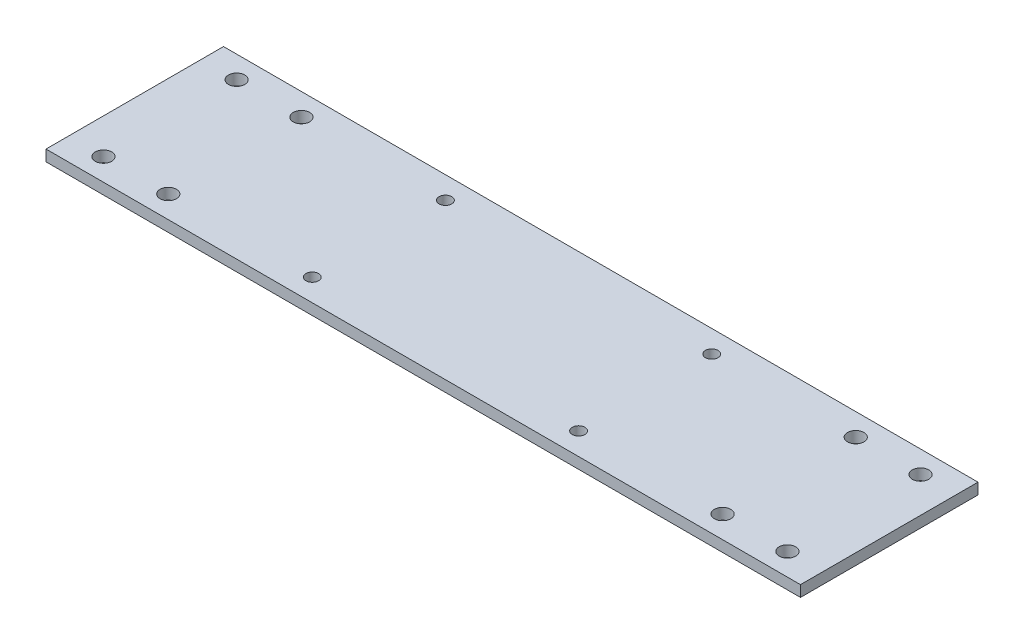
ISO-10303-21;
HEADER;
FILE_DESCRIPTION(('STEP AP214'),'2;1');
FILE_NAME('part.step','',(''),(''),'','','');
FILE_SCHEMA(('AUTOMOTIVE_DESIGN { 1 0 10303 214 1 1 1 1 }'));
ENDSEC;
DATA;
#1=APPLICATION_CONTEXT('core data for automotive mechanical design processes');
#2=APPLICATION_PROTOCOL_DEFINITION('international standard','automotive_design',2000,#1);
#3=PRODUCT_CONTEXT('',#1,'mechanical');
#4=PRODUCT('Part','Part','',(#3));
#5=PRODUCT_RELATED_PRODUCT_CATEGORY('part','',(#4));
#6=PRODUCT_DEFINITION_FORMATION('','',#4);
#7=PRODUCT_DEFINITION_CONTEXT('part definition',#1,'design');
#8=PRODUCT_DEFINITION('design','',#6,#7);
#9=PRODUCT_DEFINITION_SHAPE('','',#8);
#10=(LENGTH_UNIT() NAMED_UNIT(*) SI_UNIT(.MILLI.,.METRE.));
#11=(NAMED_UNIT(*) PLANE_ANGLE_UNIT() SI_UNIT($,.RADIAN.));
#12=(NAMED_UNIT(*) SI_UNIT($,.STERADIAN.) SOLID_ANGLE_UNIT());
#13=UNCERTAINTY_MEASURE_WITH_UNIT(LENGTH_MEASURE(1.E-05),#10,'distance_accuracy_value','');
#14=(GEOMETRIC_REPRESENTATION_CONTEXT(3) GLOBAL_UNCERTAINTY_ASSIGNED_CONTEXT((#13)) GLOBAL_UNIT_ASSIGNED_CONTEXT((#10,
#11,#12)) REPRESENTATION_CONTEXT('',''));
#15=CARTESIAN_POINT('',(0.,0.,0.));
#16=DIRECTION('',(0.,0.,1.));
#17=DIRECTION('',(1.,0.,0.));
#18=AXIS2_PLACEMENT_3D('',#15,#16,#17);
#19=CARTESIAN_POINT('',(0.,3.175,0.));
#20=DIRECTION('',(0.,-1.,0.));
#21=DIRECTION('',(0.,0.,-1.));
#22=AXIS2_PLACEMENT_3D('',#19,#20,#21);
#23=PLANE('',#22);
#24=CARTESIAN_POINT('',(97.8535,3.175,19.05));
#25=DIRECTION('',(0.,1.,0.));
#26=DIRECTION('',(0.,0.,-1.));
#27=AXIS2_PLACEMENT_3D('',#24,#25,#26);
#28=CIRCLE('',#27,2.3495);
#29=CARTESIAN_POINT('',(97.8535,3.175,16.7005));
#30=VERTEX_POINT('',#29);
#31=EDGE_CURVE('E164',#30,#30,#28,.T.);
#32=ORIENTED_EDGE('',*,*,#31,.F.);
#33=EDGE_LOOP('',(#32));
#34=FACE_BOUND('',#33,.T.);
#35=CARTESIAN_POINT('',(-97.8535,3.175,19.05));
#36=DIRECTION('',(0.,1.,0.));
#37=DIRECTION('',(0.,0.,1.));
#38=AXIS2_PLACEMENT_3D('',#35,#36,#37);
#39=CIRCLE('',#38,2.3495);
#40=CARTESIAN_POINT('',(-97.8535,3.175,21.3995));
#41=VERTEX_POINT('',#40);
#42=EDGE_CURVE('E153',#41,#41,#39,.T.);
#43=ORIENTED_EDGE('',*,*,#42,.F.);
#44=EDGE_LOOP('',(#43));
#45=FACE_BOUND('',#44,.T.);
#46=CARTESIAN_POINT('',(-79.3115,3.175,19.05));
#47=DIRECTION('',(0.,1.,0.));
#48=DIRECTION('',(0.,0.,1.));
#49=AXIS2_PLACEMENT_3D('',#46,#47,#48);
#50=CIRCLE('',#49,2.3495);
#51=CARTESIAN_POINT('',(-79.3115,3.175,21.3995));
#52=VERTEX_POINT('',#51);
#53=EDGE_CURVE('E152',#52,#52,#50,.T.);
#54=ORIENTED_EDGE('',*,*,#53,.F.);
#55=EDGE_LOOP('',(#54));
#56=FACE_BOUND('',#55,.T.);
#57=CARTESIAN_POINT('',(-79.3115,3.175,-19.05));
#58=DIRECTION('',(0.,1.,0.));
#59=DIRECTION('',(0.,0.,1.));
#60=AXIS2_PLACEMENT_3D('',#57,#58,#59);
#61=CIRCLE('',#60,2.3495);
#62=CARTESIAN_POINT('',(-79.3115,3.175,-16.7005));
#63=VERTEX_POINT('',#62);
#64=EDGE_CURVE('E146',#63,#63,#61,.T.);
#65=ORIENTED_EDGE('',*,*,#64,.F.);
#66=EDGE_LOOP('',(#65));
#67=FACE_BOUND('',#66,.T.);
#68=CARTESIAN_POINT('',(79.3115,3.175,19.05));
#69=DIRECTION('',(0.,1.,0.));
#70=DIRECTION('',(0.,0.,-1.));
#71=AXIS2_PLACEMENT_3D('',#68,#69,#70);
#72=CIRCLE('',#71,2.3495);
#73=CARTESIAN_POINT('',(79.3115,3.175,16.7005));
#74=VERTEX_POINT('',#73);
#75=EDGE_CURVE('E165',#74,#74,#72,.T.);
#76=ORIENTED_EDGE('',*,*,#75,.F.);
#77=EDGE_LOOP('',(#76));
#78=FACE_BOUND('',#77,.T.);
#79=CARTESIAN_POINT('',(79.3115,3.175,-19.05));
#80=DIRECTION('',(0.,1.,0.));
#81=DIRECTION('',(0.,0.,-1.));
#82=AXIS2_PLACEMENT_3D('',#79,#80,#81);
#83=CIRCLE('',#82,2.3495);
#84=CARTESIAN_POINT('',(79.3115,3.175,-21.3995));
#85=VERTEX_POINT('',#84);
#86=EDGE_CURVE('E182',#85,#85,#83,.T.);
#87=ORIENTED_EDGE('',*,*,#86,.F.);
#88=EDGE_LOOP('',(#87));
#89=FACE_BOUND('',#88,.T.);
#90=CARTESIAN_POINT('',(97.8535,3.175,-19.05));
#91=DIRECTION('',(0.,1.,0.));
#92=DIRECTION('',(0.,0.,-1.));
#93=AXIS2_PLACEMENT_3D('',#90,#91,#92);
#94=CIRCLE('',#93,2.3495);
#95=CARTESIAN_POINT('',(97.8535,3.175,-21.3995));
#96=VERTEX_POINT('',#95);
#97=EDGE_CURVE('E176',#96,#96,#94,.T.);
#98=ORIENTED_EDGE('',*,*,#97,.F.);
#99=EDGE_LOOP('',(#98));
#100=FACE_BOUND('',#99,.T.);
#101=CARTESIAN_POINT('',(-97.8535,3.175,-19.05));
#102=DIRECTION('',(0.,1.,0.));
#103=DIRECTION('',(0.,0.,1.));
#104=AXIS2_PLACEMENT_3D('',#101,#102,#103);
#105=CIRCLE('',#104,2.3495);
#106=CARTESIAN_POINT('',(-97.8535,3.175,-16.7005));
#107=VERTEX_POINT('',#106);
#108=EDGE_CURVE('E143',#107,#107,#105,.T.);
#109=ORIENTED_EDGE('',*,*,#108,.F.);
#110=EDGE_LOOP('',(#109));
#111=FACE_BOUND('',#110,.T.);
#112=DIRECTION('',(0.,0.,-1.));
#113=VECTOR('',#112,1.);
#114=CARTESIAN_POINT('',(107.95,3.175,25.4));
#115=LINE('',#114,#113);
#116=CARTESIAN_POINT('',(107.95,3.175,25.4));
#117=VERTEX_POINT('',#116);
#118=CARTESIAN_POINT('',(107.95,3.175,-25.4));
#119=VERTEX_POINT('',#118);
#120=EDGE_CURVE('E92',#117,#119,#115,.T.);
#121=ORIENTED_EDGE('',*,*,#120,.T.);
#122=DIRECTION('',(-1.,0.,0.));
#123=VECTOR('',#122,1.);
#124=CARTESIAN_POINT('',(-107.95,3.175,-25.4));
#125=LINE('',#124,#123);
#126=CARTESIAN_POINT('',(-107.95,3.175,-25.4));
#127=VERTEX_POINT('',#126);
#128=EDGE_CURVE('E87',#119,#127,#125,.T.);
#129=ORIENTED_EDGE('',*,*,#128,.T.);
#130=DIRECTION('',(0.,0.,1.));
#131=VECTOR('',#130,1.);
#132=CARTESIAN_POINT('',(-107.95,3.175,25.4));
#133=LINE('',#132,#131);
#134=CARTESIAN_POINT('',(-107.95,3.175,25.4));
#135=VERTEX_POINT('',#134);
#136=EDGE_CURVE('E90',#127,#135,#133,.T.);
#137=ORIENTED_EDGE('',*,*,#136,.T.);
#138=DIRECTION('',(1.,0.,0.));
#139=VECTOR('',#138,1.);
#140=CARTESIAN_POINT('',(-107.95,3.175,25.4));
#141=LINE('',#140,#139);
#142=EDGE_CURVE('E57',#135,#117,#141,.T.);
#143=ORIENTED_EDGE('',*,*,#142,.T.);
#144=EDGE_LOOP('',(#121,#129,#137,#143));
#145=FACE_BOUND('',#144,.T.);
#146=CARTESIAN_POINT('',(-38.1,3.175,-19.05));
#147=DIRECTION('',(0.,1.,0.));
#148=DIRECTION('',(0.,0.,1.));
#149=AXIS2_PLACEMENT_3D('',#146,#147,#148);
#150=CIRCLE('',#149,1.80975);
#151=CARTESIAN_POINT('',(-38.1,3.175,-17.24025));
#152=VERTEX_POINT('',#151);
#153=EDGE_CURVE('E107',#152,#152,#150,.T.);
#154=ORIENTED_EDGE('',*,*,#153,.F.);
#155=EDGE_LOOP('',(#154));
#156=FACE_BOUND('',#155,.T.);
#157=CARTESIAN_POINT('',(-38.1,3.175,19.05));
#158=DIRECTION('',(0.,1.,0.));
#159=DIRECTION('',(0.,0.,1.));
#160=AXIS2_PLACEMENT_3D('',#157,#158,#159);
#161=CIRCLE('',#160,1.80975);
#162=CARTESIAN_POINT('',(-38.1,3.175,20.85975));
#163=VERTEX_POINT('',#162);
#164=EDGE_CURVE('E122',#163,#163,#161,.T.);
#165=ORIENTED_EDGE('',*,*,#164,.F.);
#166=EDGE_LOOP('',(#165));
#167=FACE_BOUND('',#166,.T.);
#168=CARTESIAN_POINT('',(38.1,3.175,-19.05));
#169=DIRECTION('',(0.,1.,0.));
#170=DIRECTION('',(0.,0.,1.));
#171=AXIS2_PLACEMENT_3D('',#168,#169,#170);
#172=CIRCLE('',#171,1.80975);
#173=CARTESIAN_POINT('',(38.1,3.175,-17.24025));
#174=VERTEX_POINT('',#173);
#175=EDGE_CURVE('E128',#174,#174,#172,.T.);
#176=ORIENTED_EDGE('',*,*,#175,.F.);
#177=EDGE_LOOP('',(#176));
#178=FACE_BOUND('',#177,.T.);
#179=CARTESIAN_POINT('',(38.1,3.175,19.05));
#180=DIRECTION('',(0.,1.,0.));
#181=DIRECTION('',(0.,0.,1.));
#182=AXIS2_PLACEMENT_3D('',#179,#180,#181);
#183=CIRCLE('',#182,1.80975);
#184=CARTESIAN_POINT('',(38.1,3.175,20.85975));
#185=VERTEX_POINT('',#184);
#186=EDGE_CURVE('E134',#185,#185,#183,.T.);
#187=ORIENTED_EDGE('',*,*,#186,.F.);
#188=EDGE_LOOP('',(#187));
#189=FACE_BOUND('',#188,.T.);
#190=ADVANCED_FACE('F40',(#34,#45,#56,#67,#78,#89,#100,#111,#145,#156,#167,#178,#189),#23,.F.);
#191=CARTESIAN_POINT('',(0.,0.,0.));
#192=DIRECTION('',(0.,-1.,0.));
#193=DIRECTION('',(0.,0.,-1.));
#194=AXIS2_PLACEMENT_3D('',#191,#192,#193);
#195=PLANE('',#194);
#196=CARTESIAN_POINT('',(97.8535,0.,19.05));
#197=DIRECTION('',(0.,1.,0.));
#198=DIRECTION('',(0.,0.,-1.));
#199=AXIS2_PLACEMENT_3D('',#196,#197,#198);
#200=CIRCLE('',#199,2.3495);
#201=CARTESIAN_POINT('',(97.8535,0.,16.7005));
#202=VERTEX_POINT('',#201);
#203=EDGE_CURVE('E161',#202,#202,#200,.T.);
#204=ORIENTED_EDGE('',*,*,#203,.T.);
#205=EDGE_LOOP('',(#204));
#206=FACE_BOUND('',#205,.T.);
#207=CARTESIAN_POINT('',(-97.8535,0.,19.05));
#208=DIRECTION('',(0.,1.,0.));
#209=DIRECTION('',(0.,0.,1.));
#210=AXIS2_PLACEMENT_3D('',#207,#208,#209);
#211=CIRCLE('',#210,2.3495);
#212=CARTESIAN_POINT('',(-97.8535,0.,21.3995));
#213=VERTEX_POINT('',#212);
#214=EDGE_CURVE('E168',#213,#213,#211,.T.);
#215=ORIENTED_EDGE('',*,*,#214,.T.);
#216=EDGE_LOOP('',(#215));
#217=FACE_BOUND('',#216,.T.);
#218=CARTESIAN_POINT('',(-79.3115,0.,19.05));
#219=DIRECTION('',(0.,1.,0.));
#220=DIRECTION('',(0.,0.,1.));
#221=AXIS2_PLACEMENT_3D('',#218,#219,#220);
#222=CIRCLE('',#221,2.3495);
#223=CARTESIAN_POINT('',(-79.3115,0.,21.3995));
#224=VERTEX_POINT('',#223);
#225=EDGE_CURVE('E149',#224,#224,#222,.T.);
#226=ORIENTED_EDGE('',*,*,#225,.T.);
#227=EDGE_LOOP('',(#226));
#228=FACE_BOUND('',#227,.T.);
#229=CARTESIAN_POINT('',(-79.3115,0.,-19.05));
#230=DIRECTION('',(0.,1.,0.));
#231=DIRECTION('',(0.,0.,1.));
#232=AXIS2_PLACEMENT_3D('',#229,#230,#231);
#233=CIRCLE('',#232,2.3495);
#234=CARTESIAN_POINT('',(-79.3115,0.,-16.7005));
#235=VERTEX_POINT('',#234);
#236=EDGE_CURVE('E156',#235,#235,#233,.T.);
#237=ORIENTED_EDGE('',*,*,#236,.T.);
#238=EDGE_LOOP('',(#237));
#239=FACE_BOUND('',#238,.T.);
#240=CARTESIAN_POINT('',(79.3115,0.,19.05));
#241=DIRECTION('',(0.,1.,0.));
#242=DIRECTION('',(0.,0.,-1.));
#243=AXIS2_PLACEMENT_3D('',#240,#241,#242);
#244=CIRCLE('',#243,2.3495);
#245=CARTESIAN_POINT('',(79.3115,0.,16.7005));
#246=VERTEX_POINT('',#245);
#247=EDGE_CURVE('E185',#246,#246,#244,.T.);
#248=ORIENTED_EDGE('',*,*,#247,.T.);
#249=EDGE_LOOP('',(#248));
#250=FACE_BOUND('',#249,.T.);
#251=CARTESIAN_POINT('',(79.3115,0.,-19.05));
#252=DIRECTION('',(0.,1.,0.));
#253=DIRECTION('',(0.,0.,-1.));
#254=AXIS2_PLACEMENT_3D('',#251,#252,#253);
#255=CIRCLE('',#254,2.3495);
#256=CARTESIAN_POINT('',(79.3115,0.,-21.3995));
#257=VERTEX_POINT('',#256);
#258=EDGE_CURVE('E179',#257,#257,#255,.T.);
#259=ORIENTED_EDGE('',*,*,#258,.T.);
#260=EDGE_LOOP('',(#259));
#261=FACE_BOUND('',#260,.T.);
#262=CARTESIAN_POINT('',(97.8535,0.,-19.05));
#263=DIRECTION('',(0.,1.,0.));
#264=DIRECTION('',(0.,0.,-1.));
#265=AXIS2_PLACEMENT_3D('',#262,#263,#264);
#266=CIRCLE('',#265,2.3495);
#267=CARTESIAN_POINT('',(97.8535,0.,-21.3995));
#268=VERTEX_POINT('',#267);
#269=EDGE_CURVE('E173',#268,#268,#266,.T.);
#270=ORIENTED_EDGE('',*,*,#269,.T.);
#271=EDGE_LOOP('',(#270));
#272=FACE_BOUND('',#271,.T.);
#273=CARTESIAN_POINT('',(-97.8535,0.,-19.05));
#274=DIRECTION('',(0.,1.,0.));
#275=DIRECTION('',(0.,0.,1.));
#276=AXIS2_PLACEMENT_3D('',#273,#274,#275);
#277=CIRCLE('',#276,2.3495);
#278=CARTESIAN_POINT('',(-97.8535,0.,-16.7005));
#279=VERTEX_POINT('',#278);
#280=EDGE_CURVE('E140',#279,#279,#277,.T.);
#281=ORIENTED_EDGE('',*,*,#280,.T.);
#282=EDGE_LOOP('',(#281));
#283=FACE_BOUND('',#282,.T.);
#284=CARTESIAN_POINT('',(38.1,0.,-19.05));
#285=DIRECTION('',(0.,1.,0.));
#286=DIRECTION('',(0.,0.,1.));
#287=AXIS2_PLACEMENT_3D('',#284,#285,#286);
#288=CIRCLE('',#287,1.80975);
#289=CARTESIAN_POINT('',(38.1,0.,-17.24025));
#290=VERTEX_POINT('',#289);
#291=EDGE_CURVE('E131',#290,#290,#288,.T.);
#292=ORIENTED_EDGE('',*,*,#291,.T.);
#293=EDGE_LOOP('',(#292));
#294=FACE_BOUND('',#293,.T.);
#295=CARTESIAN_POINT('',(-38.1,0.,-19.05));
#296=DIRECTION('',(0.,1.,0.));
#297=DIRECTION('',(0.,0.,1.));
#298=AXIS2_PLACEMENT_3D('',#295,#296,#297);
#299=CIRCLE('',#298,1.80975);
#300=CARTESIAN_POINT('',(-38.1,0.,-17.24025));
#301=VERTEX_POINT('',#300);
#302=EDGE_CURVE('E119',#301,#301,#299,.T.);
#303=ORIENTED_EDGE('',*,*,#302,.T.);
#304=EDGE_LOOP('',(#303));
#305=FACE_BOUND('',#304,.T.);
#306=DIRECTION('',(0.,0.,-1.));
#307=VECTOR('',#306,1.);
#308=CARTESIAN_POINT('',(107.95,0.,25.4));
#309=LINE('',#308,#307);
#310=CARTESIAN_POINT('',(107.95,0.,25.4));
#311=VERTEX_POINT('',#310);
#312=CARTESIAN_POINT('',(107.95,0.,-25.4));
#313=VERTEX_POINT('',#312);
#314=EDGE_CURVE('E104',#311,#313,#309,.T.);
#315=ORIENTED_EDGE('',*,*,#314,.F.);
#316=DIRECTION('',(1.,0.,0.));
#317=VECTOR('',#316,1.);
#318=CARTESIAN_POINT('',(-107.95,0.,25.4));
#319=LINE('',#318,#317);
#320=CARTESIAN_POINT('',(-107.95,0.,25.4));
#321=VERTEX_POINT('',#320);
#322=EDGE_CURVE('E80',#321,#311,#319,.T.);
#323=ORIENTED_EDGE('',*,*,#322,.F.);
#324=DIRECTION('',(0.,0.,1.));
#325=VECTOR('',#324,1.);
#326=CARTESIAN_POINT('',(-107.95,0.,25.4));
#327=LINE('',#326,#325);
#328=CARTESIAN_POINT('',(-107.95,0.,-25.4));
#329=VERTEX_POINT('',#328);
#330=EDGE_CURVE('E74',#329,#321,#327,.T.);
#331=ORIENTED_EDGE('',*,*,#330,.F.);
#332=DIRECTION('',(-1.,0.,0.));
#333=VECTOR('',#332,1.);
#334=CARTESIAN_POINT('',(-107.95,0.,-25.4));
#335=LINE('',#334,#333);
#336=EDGE_CURVE('E96',#313,#329,#335,.T.);
#337=ORIENTED_EDGE('',*,*,#336,.F.);
#338=EDGE_LOOP('',(#315,#323,#331,#337));
#339=FACE_BOUND('',#338,.T.);
#340=CARTESIAN_POINT('',(-38.1,0.,19.05));
#341=DIRECTION('',(0.,1.,0.));
#342=DIRECTION('',(0.,0.,1.));
#343=AXIS2_PLACEMENT_3D('',#340,#341,#342);
#344=CIRCLE('',#343,1.80975);
#345=CARTESIAN_POINT('',(-38.1,0.,20.85975));
#346=VERTEX_POINT('',#345);
#347=EDGE_CURVE('E125',#346,#346,#344,.T.);
#348=ORIENTED_EDGE('',*,*,#347,.T.);
#349=EDGE_LOOP('',(#348));
#350=FACE_BOUND('',#349,.T.);
#351=CARTESIAN_POINT('',(38.1,0.,19.05));
#352=DIRECTION('',(0.,1.,0.));
#353=DIRECTION('',(0.,0.,1.));
#354=AXIS2_PLACEMENT_3D('',#351,#352,#353);
#355=CIRCLE('',#354,1.80975);
#356=CARTESIAN_POINT('',(38.1,0.,20.85975));
#357=VERTEX_POINT('',#356);
#358=EDGE_CURVE('E137',#357,#357,#355,.T.);
#359=ORIENTED_EDGE('',*,*,#358,.T.);
#360=EDGE_LOOP('',(#359));
#361=FACE_BOUND('',#360,.T.);
#362=ADVANCED_FACE('F115',(#206,#217,#228,#239,#250,#261,#272,#283,#294,#305,#339,#350,#361),
#195,.T.);
#363=CARTESIAN_POINT('',(107.95,3.175,25.4));
#364=DIRECTION('',(-1.,0.,0.));
#365=DIRECTION('',(0.,0.,1.));
#366=AXIS2_PLACEMENT_3D('',#363,#364,#365);
#367=PLANE('',#366);
#368=ORIENTED_EDGE('',*,*,#314,.T.);
#369=DIRECTION('',(0.,-1.,0.));
#370=VECTOR('',#369,1.);
#371=CARTESIAN_POINT('',(107.95,3.175,-25.4));
#372=LINE('',#371,#370);
#373=EDGE_CURVE('E11',#119,#313,#372,.T.);
#374=ORIENTED_EDGE('',*,*,#373,.F.);
#375=ORIENTED_EDGE('',*,*,#120,.F.);
#376=DIRECTION('',(0.,-1.,0.));
#377=VECTOR('',#376,1.);
#378=CARTESIAN_POINT('',(107.95,3.175,25.4));
#379=LINE('',#378,#377);
#380=EDGE_CURVE('E100',#117,#311,#379,.T.);
#381=ORIENTED_EDGE('',*,*,#380,.T.);
#382=EDGE_LOOP('',(#368,#374,#375,#381));
#383=FACE_BOUND('',#382,.T.);
#384=ADVANCED_FACE('F42',(#383),#367,.F.);
#385=CARTESIAN_POINT('',(-107.95,3.175,-25.4));
#386=DIRECTION('',(0.,0.,1.));
#387=DIRECTION('',(1.,0.,0.));
#388=AXIS2_PLACEMENT_3D('',#385,#386,#387);
#389=PLANE('',#388);
#390=ORIENTED_EDGE('',*,*,#336,.T.);
#391=DIRECTION('',(0.,-1.,0.));
#392=VECTOR('',#391,1.);
#393=CARTESIAN_POINT('',(-107.95,3.175,-25.4));
#394=LINE('',#393,#392);
#395=EDGE_CURVE('E49',#127,#329,#394,.T.);
#396=ORIENTED_EDGE('',*,*,#395,.F.);
#397=ORIENTED_EDGE('',*,*,#128,.F.);
#398=ORIENTED_EDGE('',*,*,#373,.T.);
#399=EDGE_LOOP('',(#390,#396,#397,#398));
#400=FACE_BOUND('',#399,.T.);
#401=ADVANCED_FACE('F95',(#400),#389,.F.);
#402=CARTESIAN_POINT('',(-107.95,3.175,25.4));
#403=DIRECTION('',(1.,0.,0.));
#404=DIRECTION('',(0.,0.,-1.));
#405=AXIS2_PLACEMENT_3D('',#402,#403,#404);
#406=PLANE('',#405);
#407=ORIENTED_EDGE('',*,*,#330,.T.);
#408=DIRECTION('',(0.,-1.,0.));
#409=VECTOR('',#408,1.);
#410=CARTESIAN_POINT('',(-107.95,3.175,25.4));
#411=LINE('',#410,#409);
#412=EDGE_CURVE('E97',#135,#321,#411,.T.);
#413=ORIENTED_EDGE('',*,*,#412,.F.);
#414=ORIENTED_EDGE('',*,*,#136,.F.);
#415=ORIENTED_EDGE('',*,*,#395,.T.);
#416=EDGE_LOOP('',(#407,#413,#414,#415));
#417=FACE_BOUND('',#416,.T.);
#418=ADVANCED_FACE('F98',(#417),#406,.F.);
#419=CARTESIAN_POINT('',(-107.95,3.175,25.4));
#420=DIRECTION('',(0.,0.,-1.));
#421=DIRECTION('',(-1.,0.,0.));
#422=AXIS2_PLACEMENT_3D('',#419,#420,#421);
#423=PLANE('',#422);
#424=ORIENTED_EDGE('',*,*,#322,.T.);
#425=ORIENTED_EDGE('',*,*,#380,.F.);
#426=ORIENTED_EDGE('',*,*,#142,.F.);
#427=ORIENTED_EDGE('',*,*,#412,.T.);
#428=EDGE_LOOP('',(#424,#425,#426,#427));
#429=FACE_BOUND('',#428,.T.);
#430=ADVANCED_FACE('F112',(#429),#423,.F.);
#431=CARTESIAN_POINT('',(-38.1,3.175,-19.05));
#432=DIRECTION('',(0.,-1.,0.));
#433=DIRECTION('',(0.,0.,-1.));
#434=AXIS2_PLACEMENT_3D('',#431,#432,#433);
#435=CYLINDRICAL_SURFACE('',#434,1.80975);
#436=ORIENTED_EDGE('',*,*,#153,.T.);
#437=EDGE_LOOP('',(#436));
#438=FACE_BOUND('',#437,.T.);
#439=ORIENTED_EDGE('',*,*,#302,.F.);
#440=EDGE_LOOP('',(#439));
#441=FACE_BOUND('',#440,.T.);
#442=ADVANCED_FACE('F231',(#438,#441),#435,.F.);
#443=CARTESIAN_POINT('',(-38.1,3.175,19.05));
#444=DIRECTION('',(0.,-1.,0.));
#445=DIRECTION('',(0.,0.,-1.));
#446=AXIS2_PLACEMENT_3D('',#443,#444,#445);
#447=CYLINDRICAL_SURFACE('',#446,1.80975);
#448=ORIENTED_EDGE('',*,*,#164,.T.);
#449=EDGE_LOOP('',(#448));
#450=FACE_BOUND('',#449,.T.);
#451=ORIENTED_EDGE('',*,*,#347,.F.);
#452=EDGE_LOOP('',(#451));
#453=FACE_BOUND('',#452,.T.);
#454=ADVANCED_FACE('F227',(#450,#453),#447,.F.);
#455=CARTESIAN_POINT('',(38.1,3.175,-19.05));
#456=DIRECTION('',(0.,-1.,0.));
#457=DIRECTION('',(0.,0.,-1.));
#458=AXIS2_PLACEMENT_3D('',#455,#456,#457);
#459=CYLINDRICAL_SURFACE('',#458,1.80975);
#460=ORIENTED_EDGE('',*,*,#175,.T.);
#461=EDGE_LOOP('',(#460));
#462=FACE_BOUND('',#461,.T.);
#463=ORIENTED_EDGE('',*,*,#291,.F.);
#464=EDGE_LOOP('',(#463));
#465=FACE_BOUND('',#464,.T.);
#466=ADVANCED_FACE('F217',(#462,#465),#459,.F.);
#467=CARTESIAN_POINT('',(38.1,3.175,19.05));
#468=DIRECTION('',(0.,-1.,0.));
#469=DIRECTION('',(0.,0.,-1.));
#470=AXIS2_PLACEMENT_3D('',#467,#468,#469);
#471=CYLINDRICAL_SURFACE('',#470,1.80975);
#472=ORIENTED_EDGE('',*,*,#186,.T.);
#473=EDGE_LOOP('',(#472));
#474=FACE_BOUND('',#473,.T.);
#475=ORIENTED_EDGE('',*,*,#358,.F.);
#476=EDGE_LOOP('',(#475));
#477=FACE_BOUND('',#476,.T.);
#478=ADVANCED_FACE('F206',(#474,#477),#471,.F.);
#479=CARTESIAN_POINT('',(-97.8535,0.,-19.05));
#480=DIRECTION('',(0.,1.,0.));
#481=DIRECTION('',(0.,0.,1.));
#482=AXIS2_PLACEMENT_3D('',#479,#480,#481);
#483=CYLINDRICAL_SURFACE('',#482,2.3495);
#484=ORIENTED_EDGE('',*,*,#280,.F.);
#485=EDGE_LOOP('',(#484));
#486=FACE_BOUND('',#485,.T.);
#487=ORIENTED_EDGE('',*,*,#108,.T.);
#488=EDGE_LOOP('',(#487));
#489=FACE_BOUND('',#488,.T.);
#490=ADVANCED_FACE('F203',(#486,#489),#483,.F.);
#491=CARTESIAN_POINT('',(97.8535,0.,-19.05));
#492=DIRECTION('',(0.,1.,0.));
#493=DIRECTION('',(0.,0.,1.));
#494=AXIS2_PLACEMENT_3D('',#491,#492,#493);
#495=CYLINDRICAL_SURFACE('',#494,2.3495);
#496=ORIENTED_EDGE('',*,*,#269,.F.);
#497=EDGE_LOOP('',(#496));
#498=FACE_BOUND('',#497,.T.);
#499=ORIENTED_EDGE('',*,*,#97,.T.);
#500=EDGE_LOOP('',(#499));
#501=FACE_BOUND('',#500,.T.);
#502=ADVANCED_FACE('F205',(#498,#501),#495,.F.);
#503=CARTESIAN_POINT('',(79.3115,0.,-19.05));
#504=DIRECTION('',(0.,1.,0.));
#505=DIRECTION('',(0.,0.,1.));
#506=AXIS2_PLACEMENT_3D('',#503,#504,#505);
#507=CYLINDRICAL_SURFACE('',#506,2.3495);
#508=ORIENTED_EDGE('',*,*,#258,.F.);
#509=EDGE_LOOP('',(#508));
#510=FACE_BOUND('',#509,.T.);
#511=ORIENTED_EDGE('',*,*,#86,.T.);
#512=EDGE_LOOP('',(#511));
#513=FACE_BOUND('',#512,.T.);
#514=ADVANCED_FACE('F213',(#510,#513),#507,.F.);
#515=CARTESIAN_POINT('',(79.3115,0.,19.05));
#516=DIRECTION('',(0.,1.,0.));
#517=DIRECTION('',(0.,0.,1.));
#518=AXIS2_PLACEMENT_3D('',#515,#516,#517);
#519=CYLINDRICAL_SURFACE('',#518,2.3495);
#520=ORIENTED_EDGE('',*,*,#247,.F.);
#521=EDGE_LOOP('',(#520));
#522=FACE_BOUND('',#521,.T.);
#523=ORIENTED_EDGE('',*,*,#75,.T.);
#524=EDGE_LOOP('',(#523));
#525=FACE_BOUND('',#524,.T.);
#526=ADVANCED_FACE('F191',(#522,#525),#519,.F.);
#527=CARTESIAN_POINT('',(-79.3115,0.,-19.05));
#528=DIRECTION('',(0.,1.,0.));
#529=DIRECTION('',(0.,0.,1.));
#530=AXIS2_PLACEMENT_3D('',#527,#528,#529);
#531=CYLINDRICAL_SURFACE('',#530,2.3495);
#532=ORIENTED_EDGE('',*,*,#236,.F.);
#533=EDGE_LOOP('',(#532));
#534=FACE_BOUND('',#533,.T.);
#535=ORIENTED_EDGE('',*,*,#64,.T.);
#536=EDGE_LOOP('',(#535));
#537=FACE_BOUND('',#536,.T.);
#538=ADVANCED_FACE('F321',(#534,#537),#531,.F.);
#539=CARTESIAN_POINT('',(-79.3115,0.,19.05));
#540=DIRECTION('',(0.,1.,0.));
#541=DIRECTION('',(0.,0.,1.));
#542=AXIS2_PLACEMENT_3D('',#539,#540,#541);
#543=CYLINDRICAL_SURFACE('',#542,2.3495);
#544=ORIENTED_EDGE('',*,*,#225,.F.);
#545=EDGE_LOOP('',(#544));
#546=FACE_BOUND('',#545,.T.);
#547=ORIENTED_EDGE('',*,*,#53,.T.);
#548=EDGE_LOOP('',(#547));
#549=FACE_BOUND('',#548,.T.);
#550=ADVANCED_FACE('F222',(#546,#549),#543,.F.);
#551=CARTESIAN_POINT('',(-97.8535,0.,19.05));
#552=DIRECTION('',(0.,1.,0.));
#553=DIRECTION('',(0.,0.,1.));
#554=AXIS2_PLACEMENT_3D('',#551,#552,#553);
#555=CYLINDRICAL_SURFACE('',#554,2.3495);
#556=ORIENTED_EDGE('',*,*,#214,.F.);
#557=EDGE_LOOP('',(#556));
#558=FACE_BOUND('',#557,.T.);
#559=ORIENTED_EDGE('',*,*,#42,.T.);
#560=EDGE_LOOP('',(#559));
#561=FACE_BOUND('',#560,.T.);
#562=ADVANCED_FACE('F339',(#558,#561),#555,.F.);
#563=CARTESIAN_POINT('',(97.8535,0.,19.05));
#564=DIRECTION('',(0.,1.,0.));
#565=DIRECTION('',(0.,0.,1.));
#566=AXIS2_PLACEMENT_3D('',#563,#564,#565);
#567=CYLINDRICAL_SURFACE('',#566,2.3495);
#568=ORIENTED_EDGE('',*,*,#203,.F.);
#569=EDGE_LOOP('',(#568));
#570=FACE_BOUND('',#569,.T.);
#571=ORIENTED_EDGE('',*,*,#31,.T.);
#572=EDGE_LOOP('',(#571));
#573=FACE_BOUND('',#572,.T.);
#574=ADVANCED_FACE('F348',(#570,#573),#567,.F.);
#575=CLOSED_SHELL('',(#190,#362,#384,#401,#418,#430,#442,#454,#466,#478,#490,#502,#514,#526,
#538,#550,#562,#574));
#576=MANIFOLD_SOLID_BREP('B2',#575);
#577=ADVANCED_BREP_SHAPE_REPRESENTATION('',(#18,#576),#14);
#578=SHAPE_DEFINITION_REPRESENTATION(#9,#577);
ENDSEC;
END-ISO-10303-21;
